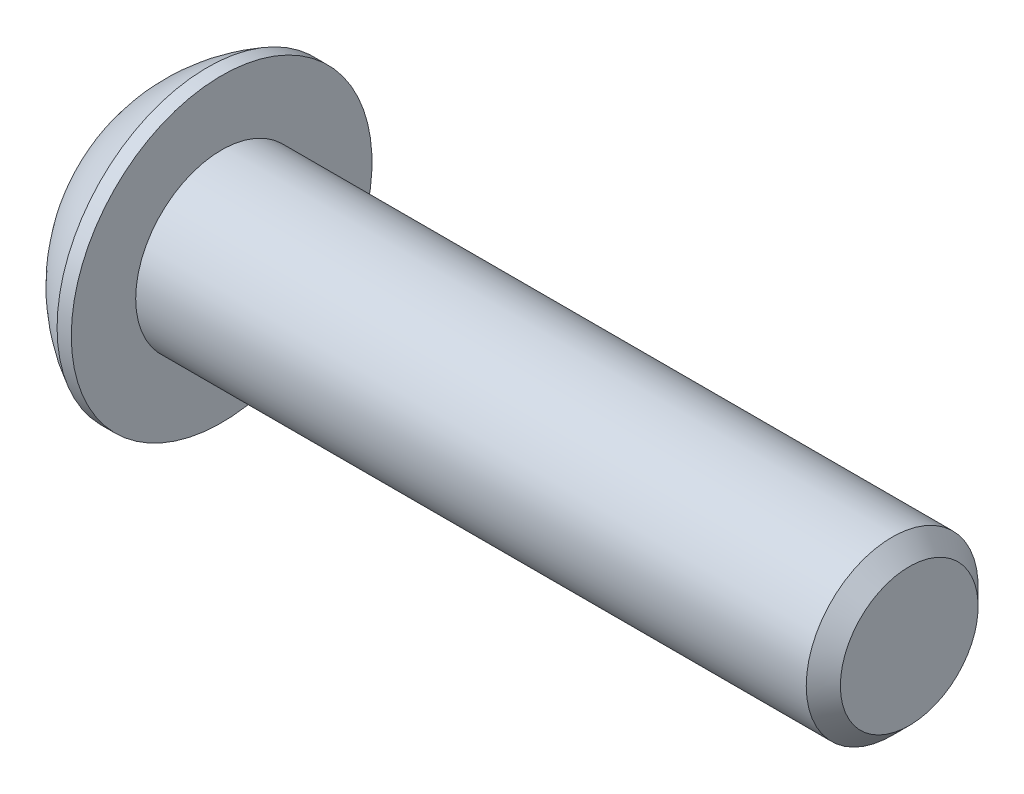
ISO-10303-21;
HEADER;
FILE_DESCRIPTION(('STEP AP214'),'2;1');
FILE_NAME('part.step','',(''),(''),'','','');
FILE_SCHEMA(('AUTOMOTIVE_DESIGN { 1 0 10303 214 1 1 1 1 }'));
ENDSEC;
DATA;
#1=APPLICATION_CONTEXT('core data for automotive mechanical design processes');
#2=APPLICATION_PROTOCOL_DEFINITION('international standard','automotive_design',2000,#1);
#3=PRODUCT_CONTEXT('',#1,'mechanical');
#4=PRODUCT('Part','Part','',(#3));
#5=PRODUCT_RELATED_PRODUCT_CATEGORY('part','',(#4));
#6=PRODUCT_DEFINITION_FORMATION('','',#4);
#7=PRODUCT_DEFINITION_CONTEXT('part definition',#1,'design');
#8=PRODUCT_DEFINITION('design','',#6,#7);
#9=PRODUCT_DEFINITION_SHAPE('','',#8);
#10=(LENGTH_UNIT() NAMED_UNIT(*) SI_UNIT(.MILLI.,.METRE.));
#11=(NAMED_UNIT(*) PLANE_ANGLE_UNIT() SI_UNIT($,.RADIAN.));
#12=(NAMED_UNIT(*) SI_UNIT($,.STERADIAN.) SOLID_ANGLE_UNIT());
#13=UNCERTAINTY_MEASURE_WITH_UNIT(LENGTH_MEASURE(1.E-05),#10,'distance_accuracy_value','');
#14=(GEOMETRIC_REPRESENTATION_CONTEXT(3) GLOBAL_UNCERTAINTY_ASSIGNED_CONTEXT((#13)) GLOBAL_UNIT_ASSIGNED_CONTEXT((#10,
#11,#12)) REPRESENTATION_CONTEXT('',''));
#15=CARTESIAN_POINT('',(0.,0.,0.));
#16=DIRECTION('',(0.,0.,1.));
#17=DIRECTION('',(1.,0.,0.));
#18=AXIS2_PLACEMENT_3D('',#15,#16,#17);
#19=CARTESIAN_POINT('',(0.,0.,0.));
#20=DIRECTION('',(-1.,0.,0.));
#21=DIRECTION('',(0.,0.,1.));
#22=AXIS2_PLACEMENT_3D('',#19,#20,#21);
#23=PLANE('',#22);
#24=CARTESIAN_POINT('',(0.,0.,0.));
#25=DIRECTION('',(-1.,0.,0.));
#26=DIRECTION('',(0.,0.,1.));
#27=AXIS2_PLACEMENT_3D('',#24,#25,#26);
#28=CIRCLE('',#27,4.1656);
#29=CARTESIAN_POINT('',(0.,0.,4.1656));
#30=VERTEX_POINT('',#29);
#31=EDGE_CURVE('E11',#30,#30,#28,.T.);
#32=ORIENTED_EDGE('',*,*,#31,.T.);
#33=EDGE_LOOP('',(#32));
#34=FACE_BOUND('',#33,.T.);
#35=DIRECTION('',(0.,-1.,0.));
#36=VECTOR('',#35,1.);
#37=CARTESIAN_POINT('',(0.,-1.6057843036971,2.7813));
#38=LINE('',#37,#36);
#39=CARTESIAN_POINT('',(0.,1.60578430369711,2.7813));
#40=VERTEX_POINT('',#39);
#41=CARTESIAN_POINT('',(0.,-1.6057843036971,2.7813));
#42=VERTEX_POINT('',#41);
#43=EDGE_CURVE('E46',#40,#42,#38,.T.);
#44=ORIENTED_EDGE('',*,*,#43,.T.);
#45=DIRECTION('',(0.,-0.500000000000001,-0.866025403784438));
#46=VECTOR('',#45,1.);
#47=CARTESIAN_POINT('',(0.,-3.21156860739421,0.));
#48=LINE('',#47,#46);
#49=CARTESIAN_POINT('',(0.,-3.21156860739421,0.));
#50=VERTEX_POINT('',#49);
#51=EDGE_CURVE('E362',#42,#50,#48,.T.);
#52=ORIENTED_EDGE('',*,*,#51,.T.);
#53=DIRECTION('',(0.,0.5,-0.866025403784438));
#54=VECTOR('',#53,1.);
#55=CARTESIAN_POINT('',(0.,-1.6057843036971,-2.7813));
#56=LINE('',#55,#54);
#57=CARTESIAN_POINT('',(0.,-1.6057843036971,-2.7813));
#58=VERTEX_POINT('',#57);
#59=EDGE_CURVE('E126',#50,#58,#56,.T.);
#60=ORIENTED_EDGE('',*,*,#59,.T.);
#61=DIRECTION('',(0.,1.,0.));
#62=VECTOR('',#61,1.);
#63=CARTESIAN_POINT('',(0.,1.60578430369711,-2.7813));
#64=LINE('',#63,#62);
#65=CARTESIAN_POINT('',(0.,1.60578430369711,-2.7813));
#66=VERTEX_POINT('',#65);
#67=EDGE_CURVE('E365',#58,#66,#64,.T.);
#68=ORIENTED_EDGE('',*,*,#67,.T.);
#69=DIRECTION('',(0.,0.499999999999999,0.866025403784439));
#70=VECTOR('',#69,1.);
#71=CARTESIAN_POINT('',(0.,3.21156860739421,0.));
#72=LINE('',#71,#70);
#73=CARTESIAN_POINT('',(0.,3.21156860739421,0.));
#74=VERTEX_POINT('',#73);
#75=EDGE_CURVE('E367',#66,#74,#72,.T.);
#76=ORIENTED_EDGE('',*,*,#75,.T.);
#77=DIRECTION('',(0.,-0.499999999999999,0.866025403784439));
#78=VECTOR('',#77,1.);
#79=CARTESIAN_POINT('',(0.,1.60578430369711,2.7813));
#80=LINE('',#79,#78);
#81=EDGE_CURVE('E369',#74,#40,#80,.T.);
#82=ORIENTED_EDGE('',*,*,#81,.T.);
#83=EDGE_LOOP('',(#44,#52,#60,#68,#76,#82));
#84=FACE_BOUND('',#83,.T.);
#85=ADVANCED_FACE('F32',(#34,#84),#23,.T.);
#86=CARTESIAN_POINT('',(8.40952981366459,0.,0.));
#87=DIRECTION('',(-1.,0.,0.));
#88=DIRECTION('',(0.,1.,0.));
#89=AXIS2_PLACEMENT_3D('',#86,#87,#88);
#90=SPHERICAL_SURFACE('',#89,9.38469046090033);
#91=CARTESIAN_POINT('',(4.0894,0.,0.));
#92=DIRECTION('',(-1.,0.,0.));
#93=DIRECTION('',(0.,0.,1.));
#94=AXIS2_PLACEMENT_3D('',#91,#92,#93);
#95=CIRCLE('',#94,8.3312);
#96=CARTESIAN_POINT('',(4.0894,0.,8.3312));
#97=VERTEX_POINT('',#96);
#98=EDGE_CURVE('E39',#97,#97,#95,.T.);
#99=ORIENTED_EDGE('',*,*,#98,.T.);
#100=EDGE_LOOP('',(#99));
#101=FACE_BOUND('',#100,.T.);
#102=ORIENTED_EDGE('',*,*,#31,.F.);
#103=EDGE_LOOP('',(#102));
#104=FACE_BOUND('',#103,.T.);
#105=ADVANCED_FACE('F153',(#101,#104),#90,.T.);
#106=CARTESIAN_POINT('',(0.,0.,0.));
#107=DIRECTION('',(-1.,0.,0.));
#108=DIRECTION('',(0.,0.,1.));
#109=AXIS2_PLACEMENT_3D('',#106,#107,#108);
#110=CYLINDRICAL_SURFACE('',#109,8.3312);
#111=ORIENTED_EDGE('',*,*,#98,.F.);
#112=EDGE_LOOP('',(#111));
#113=FACE_BOUND('',#112,.T.);
#114=CARTESIAN_POINT('',(4.8768,0.,0.));
#115=DIRECTION('',(-1.,0.,0.));
#116=DIRECTION('',(0.,0.,1.));
#117=AXIS2_PLACEMENT_3D('',#114,#115,#116);
#118=CIRCLE('',#117,8.3312);
#119=CARTESIAN_POINT('',(4.8768,0.,8.3312));
#120=VERTEX_POINT('',#119);
#121=EDGE_CURVE('E148',#120,#120,#118,.T.);
#122=ORIENTED_EDGE('',*,*,#121,.T.);
#123=EDGE_LOOP('',(#122));
#124=FACE_BOUND('',#123,.T.);
#125=ADVANCED_FACE('F156',(#113,#124),#110,.T.);
#126=CARTESIAN_POINT('',(4.8768,4.76250000000001,0.));
#127=DIRECTION('',(-1.,0.,0.));
#128=DIRECTION('',(0.,0.,1.));
#129=AXIS2_PLACEMENT_3D('',#126,#127,#128);
#130=PLANE('',#129);
#131=ORIENTED_EDGE('',*,*,#121,.F.);
#132=EDGE_LOOP('',(#131));
#133=FACE_BOUND('',#132,.T.);
#134=CARTESIAN_POINT('',(4.8768,0.,0.));
#135=DIRECTION('',(-1.,0.,0.));
#136=DIRECTION('',(0.,0.,1.));
#137=AXIS2_PLACEMENT_3D('',#134,#135,#136);
#138=CIRCLE('',#137,4.76250000000001);
#139=CARTESIAN_POINT('',(4.8768,0.,4.76250000000001));
#140=VERTEX_POINT('',#139);
#141=EDGE_CURVE('E145',#140,#140,#138,.T.);
#142=ORIENTED_EDGE('',*,*,#141,.T.);
#143=EDGE_LOOP('',(#142));
#144=FACE_BOUND('',#143,.T.);
#145=ADVANCED_FACE('F159',(#133,#144),#130,.F.);
#146=CARTESIAN_POINT('',(0.,0.,0.));
#147=DIRECTION('',(-1.,0.,0.));
#148=DIRECTION('',(0.,0.,1.));
#149=AXIS2_PLACEMENT_3D('',#146,#147,#148);
#150=CYLINDRICAL_SURFACE('',#149,4.7625);
#151=ORIENTED_EDGE('',*,*,#141,.F.);
#152=EDGE_LOOP('',(#151));
#153=FACE_BOUND('',#152,.T.);
#154=CARTESIAN_POINT('',(42.03065,0.,0.));
#155=DIRECTION('',(-1.,0.,0.));
#156=DIRECTION('',(0.,0.,1.));
#157=AXIS2_PLACEMENT_3D('',#154,#155,#156);
#158=CIRCLE('',#157,4.7625);
#159=CARTESIAN_POINT('',(42.03065,0.,4.7625));
#160=VERTEX_POINT('',#159);
#161=EDGE_CURVE('E142',#160,#160,#158,.T.);
#162=ORIENTED_EDGE('',*,*,#161,.T.);
#163=EDGE_LOOP('',(#162));
#164=FACE_BOUND('',#163,.T.);
#165=ADVANCED_FACE('F165',(#153,#164),#150,.T.);
#166=CARTESIAN_POINT('',(42.9768,0.,0.));
#167=DIRECTION('',(-1.,0.,0.));
#168=DIRECTION('',(0.,0.,1.));
#169=AXIS2_PLACEMENT_3D('',#166,#167,#168);
#170=CONICAL_SURFACE('',#169,3.81635,0.785398163397441);
#171=ORIENTED_EDGE('',*,*,#161,.F.);
#172=EDGE_LOOP('',(#171));
#173=FACE_BOUND('',#172,.T.);
#174=CARTESIAN_POINT('',(42.9768,0.,0.));
#175=DIRECTION('',(-1.,0.,0.));
#176=DIRECTION('',(0.,0.,1.));
#177=AXIS2_PLACEMENT_3D('',#174,#175,#176);
#178=CIRCLE('',#177,3.81635);
#179=CARTESIAN_POINT('',(42.9768,0.,3.81635));
#180=VERTEX_POINT('',#179);
#181=EDGE_CURVE('E138',#180,#180,#178,.T.);
#182=ORIENTED_EDGE('',*,*,#181,.T.);
#183=EDGE_LOOP('',(#182));
#184=FACE_BOUND('',#183,.T.);
#185=ADVANCED_FACE('F171',(#173,#184),#170,.T.);
#186=CARTESIAN_POINT('',(42.9768,0.,0.));
#187=DIRECTION('',(-1.,0.,0.));
#188=DIRECTION('',(0.,0.,1.));
#189=AXIS2_PLACEMENT_3D('',#186,#187,#188);
#190=PLANE('',#189);
#191=ORIENTED_EDGE('',*,*,#181,.F.);
#192=EDGE_LOOP('',(#191));
#193=FACE_BOUND('',#192,.T.);
#194=ADVANCED_FACE('F177',(#193),#190,.F.);
#195=CARTESIAN_POINT('',(3.0988,-3.21156860739421,0.));
#196=DIRECTION('',(0.,0.866025403784438,-0.500000000000001));
#197=DIRECTION('',(0.,0.500000000000001,0.866025403784438));
#198=AXIS2_PLACEMENT_3D('',#195,#196,#197);
#199=PLANE('',#198);
#200=DIRECTION('',(0.,-0.500000000000001,-0.866025403784438));
#201=VECTOR('',#200,1.);
#202=CARTESIAN_POINT('',(3.0988,-3.21156860739421,0.));
#203=LINE('',#202,#201);
#204=CARTESIAN_POINT('',(3.0988,-1.6057843036971,2.7813));
#205=VERTEX_POINT('',#204);
#206=CARTESIAN_POINT('',(3.0988,-2.40867645554566,1.39065));
#207=VERTEX_POINT('',#206);
#208=EDGE_CURVE('E112',#205,#207,#203,.T.);
#209=ORIENTED_EDGE('',*,*,#208,.T.);
#210=CARTESIAN_POINT('',(3.0988,-3.21156860739421,0.));
#211=VERTEX_POINT('',#210);
#212=EDGE_CURVE('E107',#207,#211,#203,.T.);
#213=ORIENTED_EDGE('',*,*,#212,.T.);
#214=DIRECTION('',(-1.,0.,0.));
#215=VECTOR('',#214,1.);
#216=CARTESIAN_POINT('',(3.0988,-3.21156860739421,0.));
#217=LINE('',#216,#215);
#218=EDGE_CURVE('E109',#211,#50,#217,.T.);
#219=ORIENTED_EDGE('',*,*,#218,.T.);
#220=ORIENTED_EDGE('',*,*,#51,.F.);
#221=DIRECTION('',(-1.,0.,0.));
#222=VECTOR('',#221,1.);
#223=CARTESIAN_POINT('',(3.0988,-1.6057843036971,2.7813));
#224=LINE('',#223,#222);
#225=EDGE_CURVE('E357',#205,#42,#224,.T.);
#226=ORIENTED_EDGE('',*,*,#225,.F.);
#227=EDGE_LOOP('',(#209,#213,#219,#220,#226));
#228=FACE_BOUND('',#227,.T.);
#229=ADVANCED_FACE('F108',(#228),#199,.T.);
#230=CARTESIAN_POINT('',(3.0988,-1.6057843036971,-2.7813));
#231=DIRECTION('',(0.,0.866025403784438,0.5));
#232=DIRECTION('',(0.,-0.5,0.866025403784438));
#233=AXIS2_PLACEMENT_3D('',#230,#231,#232);
#234=PLANE('',#233);
#235=DIRECTION('',(0.,0.5,-0.866025403784438));
#236=VECTOR('',#235,1.);
#237=CARTESIAN_POINT('',(3.0988,-1.6057843036971,-2.7813));
#238=LINE('',#237,#236);
#239=CARTESIAN_POINT('',(3.0988,-2.40867645554566,-1.39065));
#240=VERTEX_POINT('',#239);
#241=EDGE_CURVE('E54',#211,#240,#238,.T.);
#242=ORIENTED_EDGE('',*,*,#241,.T.);
#243=CARTESIAN_POINT('',(3.0988,-1.6057843036971,-2.7813));
#244=VERTEX_POINT('',#243);
#245=EDGE_CURVE('E121',#240,#244,#238,.T.);
#246=ORIENTED_EDGE('',*,*,#245,.T.);
#247=DIRECTION('',(-1.,0.,0.));
#248=VECTOR('',#247,1.);
#249=CARTESIAN_POINT('',(3.0988,-1.6057843036971,-2.7813));
#250=LINE('',#249,#248);
#251=EDGE_CURVE('E128',#244,#58,#250,.T.);
#252=ORIENTED_EDGE('',*,*,#251,.T.);
#253=ORIENTED_EDGE('',*,*,#59,.F.);
#254=ORIENTED_EDGE('',*,*,#218,.F.);
#255=EDGE_LOOP('',(#242,#246,#252,#253,#254));
#256=FACE_BOUND('',#255,.T.);
#257=ADVANCED_FACE('F124',(#256),#234,.T.);
#258=CARTESIAN_POINT('',(3.0988,1.60578430369711,-2.7813));
#259=DIRECTION('',(0.,0.,1.));
#260=DIRECTION('',(0.,-1.,0.));
#261=AXIS2_PLACEMENT_3D('',#258,#259,#260);
#262=PLANE('',#261);
#263=DIRECTION('',(0.,1.,0.));
#264=VECTOR('',#263,1.);
#265=CARTESIAN_POINT('',(3.0988,1.60578430369711,-2.7813));
#266=LINE('',#265,#264);
#267=CARTESIAN_POINT('',(3.0988,0.,-2.7813));
#268=VERTEX_POINT('',#267);
#269=EDGE_CURVE('E387',#244,#268,#266,.T.);
#270=ORIENTED_EDGE('',*,*,#269,.T.);
#271=CARTESIAN_POINT('',(3.0988,1.60578430369711,-2.7813));
#272=VERTEX_POINT('',#271);
#273=EDGE_CURVE('E120',#268,#272,#266,.T.);
#274=ORIENTED_EDGE('',*,*,#273,.T.);
#275=DIRECTION('',(-1.,0.,0.));
#276=VECTOR('',#275,1.);
#277=CARTESIAN_POINT('',(3.0988,1.60578430369711,-2.7813));
#278=LINE('',#277,#276);
#279=EDGE_CURVE('E133',#272,#66,#278,.T.);
#280=ORIENTED_EDGE('',*,*,#279,.T.);
#281=ORIENTED_EDGE('',*,*,#67,.F.);
#282=ORIENTED_EDGE('',*,*,#251,.F.);
#283=EDGE_LOOP('',(#270,#274,#280,#281,#282));
#284=FACE_BOUND('',#283,.T.);
#285=ADVANCED_FACE('F236',(#284),#262,.T.);
#286=CARTESIAN_POINT('',(3.0988,3.21156860739421,0.));
#287=DIRECTION('',(0.,-0.866025403784439,0.5));
#288=DIRECTION('',(0.,-0.5,-0.866025403784439));
#289=AXIS2_PLACEMENT_3D('',#286,#287,#288);
#290=PLANE('',#289);
#291=DIRECTION('',(0.,0.499999999999999,0.866025403784439));
#292=VECTOR('',#291,1.);
#293=CARTESIAN_POINT('',(3.0988,3.21156860739421,0.));
#294=LINE('',#293,#292);
#295=CARTESIAN_POINT('',(3.0988,2.40867645554566,-1.39065));
#296=VERTEX_POINT('',#295);
#297=EDGE_CURVE('E391',#272,#296,#294,.T.);
#298=ORIENTED_EDGE('',*,*,#297,.T.);
#299=CARTESIAN_POINT('',(3.0988,3.21156860739421,0.));
#300=VERTEX_POINT('',#299);
#301=EDGE_CURVE('E389',#296,#300,#294,.T.);
#302=ORIENTED_EDGE('',*,*,#301,.T.);
#303=DIRECTION('',(-1.,0.,0.));
#304=VECTOR('',#303,1.);
#305=CARTESIAN_POINT('',(3.0988,3.21156860739421,0.));
#306=LINE('',#305,#304);
#307=EDGE_CURVE('E373',#300,#74,#306,.T.);
#308=ORIENTED_EDGE('',*,*,#307,.T.);
#309=ORIENTED_EDGE('',*,*,#75,.F.);
#310=ORIENTED_EDGE('',*,*,#279,.F.);
#311=EDGE_LOOP('',(#298,#302,#308,#309,#310));
#312=FACE_BOUND('',#311,.T.);
#313=ADVANCED_FACE('F245',(#312),#290,.T.);
#314=CARTESIAN_POINT('',(3.0988,1.60578430369711,2.7813));
#315=DIRECTION('',(0.,-0.866025403784439,-0.499999999999999));
#316=DIRECTION('',(0.,0.499999999999999,-0.866025403784439));
#317=AXIS2_PLACEMENT_3D('',#314,#315,#316);
#318=PLANE('',#317);
#319=DIRECTION('',(0.,-0.499999999999999,0.866025403784439));
#320=VECTOR('',#319,1.);
#321=CARTESIAN_POINT('',(3.0988,1.60578430369711,2.7813));
#322=LINE('',#321,#320);
#323=CARTESIAN_POINT('',(3.0988,2.40867645554566,1.39065));
#324=VERTEX_POINT('',#323);
#325=EDGE_CURVE('E352',#300,#324,#322,.T.);
#326=ORIENTED_EDGE('',*,*,#325,.T.);
#327=CARTESIAN_POINT('',(3.0988,1.60578430369711,2.7813));
#328=VERTEX_POINT('',#327);
#329=EDGE_CURVE('E348',#324,#328,#322,.T.);
#330=ORIENTED_EDGE('',*,*,#329,.T.);
#331=DIRECTION('',(-1.,0.,0.));
#332=VECTOR('',#331,1.);
#333=CARTESIAN_POINT('',(3.0988,1.60578430369711,2.7813));
#334=LINE('',#333,#332);
#335=EDGE_CURVE('E356',#328,#40,#334,.T.);
#336=ORIENTED_EDGE('',*,*,#335,.T.);
#337=ORIENTED_EDGE('',*,*,#81,.F.);
#338=ORIENTED_EDGE('',*,*,#307,.F.);
#339=EDGE_LOOP('',(#326,#330,#336,#337,#338));
#340=FACE_BOUND('',#339,.T.);
#341=ADVANCED_FACE('F255',(#340),#318,.T.);
#342=CARTESIAN_POINT('',(3.0988,-1.6057843036971,2.7813));
#343=DIRECTION('',(0.,0.,-1.));
#344=DIRECTION('',(0.,1.,0.));
#345=AXIS2_PLACEMENT_3D('',#342,#343,#344);
#346=PLANE('',#345);
#347=DIRECTION('',(0.,-1.,0.));
#348=VECTOR('',#347,1.);
#349=CARTESIAN_POINT('',(3.0988,-1.6057843036971,2.7813));
#350=LINE('',#349,#348);
#351=CARTESIAN_POINT('',(3.0988,0.,2.7813));
#352=VERTEX_POINT('',#351);
#353=EDGE_CURVE('E347',#328,#352,#350,.T.);
#354=ORIENTED_EDGE('',*,*,#353,.T.);
#355=EDGE_CURVE('E350',#352,#205,#350,.T.);
#356=ORIENTED_EDGE('',*,*,#355,.T.);
#357=ORIENTED_EDGE('',*,*,#225,.T.);
#358=ORIENTED_EDGE('',*,*,#43,.F.);
#359=ORIENTED_EDGE('',*,*,#335,.F.);
#360=EDGE_LOOP('',(#354,#356,#357,#358,#359));
#361=FACE_BOUND('',#360,.T.);
#362=ADVANCED_FACE('F265',(#361),#346,.T.);
#363=CARTESIAN_POINT('',(3.0988,-3.21156860739421,0.));
#364=DIRECTION('',(1.,0.,0.));
#365=DIRECTION('',(0.,0.,-1.));
#366=AXIS2_PLACEMENT_3D('',#363,#364,#365);
#367=PLANE('',#366);
#368=CARTESIAN_POINT('',(3.0988,0.,0.));
#369=DIRECTION('',(-1.,0.,0.));
#370=DIRECTION('',(0.,0.,1.));
#371=AXIS2_PLACEMENT_3D('',#368,#369,#370);
#372=CIRCLE('',#371,2.7813);
#373=EDGE_CURVE('E394',#296,#268,#372,.T.);
#374=ORIENTED_EDGE('',*,*,#373,.F.);
#375=ORIENTED_EDGE('',*,*,#297,.F.);
#376=ORIENTED_EDGE('',*,*,#273,.F.);
#377=EDGE_LOOP('',(#374,#375,#376));
#378=FACE_BOUND('',#377,.T.);
#379=ADVANCED_FACE('F275',(#378),#367,.F.);
#380=EDGE_CURVE('E139',#324,#296,#372,.T.);
#381=ORIENTED_EDGE('',*,*,#380,.F.);
#382=ORIENTED_EDGE('',*,*,#325,.F.);
#383=ORIENTED_EDGE('',*,*,#301,.F.);
#384=EDGE_LOOP('',(#381,#382,#383));
#385=FACE_BOUND('',#384,.T.);
#386=ADVANCED_FACE('F285',(#385),#367,.F.);
#387=EDGE_CURVE('E132',#352,#324,#372,.T.);
#388=ORIENTED_EDGE('',*,*,#387,.F.);
#389=ORIENTED_EDGE('',*,*,#353,.F.);
#390=ORIENTED_EDGE('',*,*,#329,.F.);
#391=EDGE_LOOP('',(#388,#389,#390));
#392=FACE_BOUND('',#391,.T.);
#393=ADVANCED_FACE('F296',(#392),#367,.F.);
#394=EDGE_CURVE('E127',#207,#352,#372,.T.);
#395=ORIENTED_EDGE('',*,*,#394,.F.);
#396=ORIENTED_EDGE('',*,*,#208,.F.);
#397=ORIENTED_EDGE('',*,*,#355,.F.);
#398=EDGE_LOOP('',(#395,#396,#397));
#399=FACE_BOUND('',#398,.T.);
#400=ADVANCED_FACE('F305',(#399),#367,.F.);
#401=EDGE_CURVE('E118',#240,#207,#372,.T.);
#402=ORIENTED_EDGE('',*,*,#401,.F.);
#403=ORIENTED_EDGE('',*,*,#241,.F.);
#404=ORIENTED_EDGE('',*,*,#212,.F.);
#405=EDGE_LOOP('',(#402,#403,#404));
#406=FACE_BOUND('',#405,.T.);
#407=ADVANCED_FACE('F117',(#406),#367,.F.);
#408=EDGE_CURVE('E388',#268,#240,#372,.T.);
#409=ORIENTED_EDGE('',*,*,#408,.F.);
#410=ORIENTED_EDGE('',*,*,#269,.F.);
#411=ORIENTED_EDGE('',*,*,#245,.F.);
#412=EDGE_LOOP('',(#409,#410,#411));
#413=FACE_BOUND('',#412,.T.);
#414=ADVANCED_FACE('F288',(#413),#367,.F.);
#415=CARTESIAN_POINT('',(4.70458430369712,0.,0.));
#416=DIRECTION('',(-1.,0.,0.));
#417=DIRECTION('',(0.,0.,1.));
#418=AXIS2_PLACEMENT_3D('',#415,#416,#417);
#419=CONICAL_SURFACE('',#418,0.,1.04719755119659);
#420=ORIENTED_EDGE('',*,*,#387,.T.);
#421=ORIENTED_EDGE('',*,*,#380,.T.);
#422=ORIENTED_EDGE('',*,*,#373,.T.);
#423=ORIENTED_EDGE('',*,*,#408,.T.);
#424=ORIENTED_EDGE('',*,*,#401,.T.);
#425=ORIENTED_EDGE('',*,*,#394,.T.);
#426=EDGE_LOOP('',(#420,#421,#422,#423,#424,#425));
#427=FACE_BOUND('',#426,.T.);
#428=CARTESIAN_POINT('',(4.70458430369712,0.,0.));
#429=VERTEX_POINT('',#428);
#430=VERTEX_LOOP('',#429);
#431=FACE_BOUND('',#430,.T.);
#432=ADVANCED_FACE('F329',(#427,#431),#419,.F.);
#433=CLOSED_SHELL('',(#85,#105,#125,#145,#165,#185,#194,#229,#257,#285,#313,#341,#362,#379,#386,
#393,#400,#407,#414,#432));
#434=MANIFOLD_SOLID_BREP('B2',#433);
#435=ADVANCED_BREP_SHAPE_REPRESENTATION('',(#18,#434),#14);
#436=SHAPE_DEFINITION_REPRESENTATION(#9,#435);
ENDSEC;
END-ISO-10303-21;
